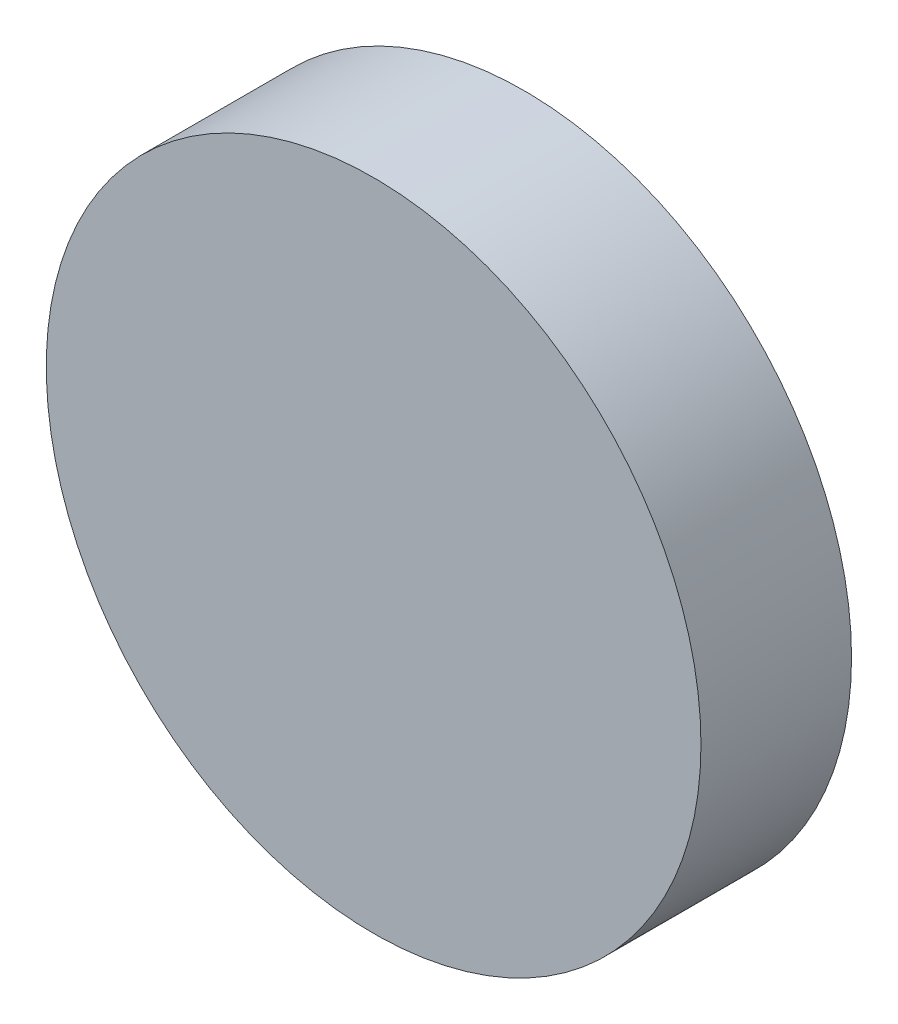
ISO-10303-21;
HEADER;
FILE_DESCRIPTION(('STEP AP214'),'2;1');
FILE_NAME('part.step','',(''),(''),'','','');
FILE_SCHEMA(('AUTOMOTIVE_DESIGN { 1 0 10303 214 1 1 1 1 }'));
ENDSEC;
DATA;
#1=APPLICATION_CONTEXT('core data for automotive mechanical design processes');
#2=APPLICATION_PROTOCOL_DEFINITION('international standard','automotive_design',2000,#1);
#3=PRODUCT_CONTEXT('',#1,'mechanical');
#4=PRODUCT('Part','Part','',(#3));
#5=PRODUCT_RELATED_PRODUCT_CATEGORY('part','',(#4));
#6=PRODUCT_DEFINITION_FORMATION('','',#4);
#7=PRODUCT_DEFINITION_CONTEXT('part definition',#1,'design');
#8=PRODUCT_DEFINITION('design','',#6,#7);
#9=PRODUCT_DEFINITION_SHAPE('','',#8);
#10=(LENGTH_UNIT() NAMED_UNIT(*) SI_UNIT(.MILLI.,.METRE.));
#11=(NAMED_UNIT(*) PLANE_ANGLE_UNIT() SI_UNIT($,.RADIAN.));
#12=(NAMED_UNIT(*) SI_UNIT($,.STERADIAN.) SOLID_ANGLE_UNIT());
#13=UNCERTAINTY_MEASURE_WITH_UNIT(LENGTH_MEASURE(1.E-05),#10,'distance_accuracy_value','');
#14=(GEOMETRIC_REPRESENTATION_CONTEXT(3) GLOBAL_UNCERTAINTY_ASSIGNED_CONTEXT((#13)) GLOBAL_UNIT_ASSIGNED_CONTEXT((#10,
#11,#12)) REPRESENTATION_CONTEXT('',''));
#15=CARTESIAN_POINT('',(0.,0.,0.));
#16=DIRECTION('',(0.,0.,1.));
#17=DIRECTION('',(1.,0.,0.));
#18=AXIS2_PLACEMENT_3D('',#15,#16,#17);
#19=CARTESIAN_POINT('',(40.499174310354,24.6252967338106,2.3));
#20=DIRECTION('',(0.,0.,-1.));
#21=DIRECTION('',(-1.,0.,0.));
#22=AXIS2_PLACEMENT_3D('',#19,#20,#21);
#23=CYLINDRICAL_SURFACE('',#22,5.);
#24=CARTESIAN_POINT('',(40.499174310354,24.6252967338106,2.3));
#25=DIRECTION('',(0.,0.,1.));
#26=DIRECTION('',(1.,0.,0.));
#27=AXIS2_PLACEMENT_3D('',#24,#25,#26);
#28=CIRCLE('',#27,5.);
#29=CARTESIAN_POINT('',(45.499174310354,24.6252967338106,2.3));
#30=VERTEX_POINT('',#29);
#31=EDGE_CURVE('E10',#30,#30,#28,.T.);
#32=ORIENTED_EDGE('',*,*,#31,.F.);
#33=EDGE_LOOP('',(#32));
#34=FACE_BOUND('',#33,.T.);
#35=CARTESIAN_POINT('',(40.499174310354,24.6252967338106,0.));
#36=DIRECTION('',(0.,0.,1.));
#37=DIRECTION('',(1.,0.,0.));
#38=AXIS2_PLACEMENT_3D('',#35,#36,#37);
#39=CIRCLE('',#38,5.);
#40=CARTESIAN_POINT('',(45.499174310354,24.6252967338106,0.));
#41=VERTEX_POINT('',#40);
#42=EDGE_CURVE('E38',#41,#41,#39,.T.);
#43=ORIENTED_EDGE('',*,*,#42,.T.);
#44=EDGE_LOOP('',(#43));
#45=FACE_BOUND('',#44,.T.);
#46=ADVANCED_FACE('F35',(#34,#45),#23,.T.);
#47=CARTESIAN_POINT('',(40.499174310354,24.6252967338106,2.3));
#48=DIRECTION('',(0.,0.,1.));
#49=DIRECTION('',(1.,0.,0.));
#50=AXIS2_PLACEMENT_3D('',#47,#48,#49);
#51=PLANE('',#50);
#52=ORIENTED_EDGE('',*,*,#31,.T.);
#53=EDGE_LOOP('',(#52));
#54=FACE_BOUND('',#53,.T.);
#55=ADVANCED_FACE('F50',(#54),#51,.T.);
#56=CARTESIAN_POINT('',(40.499174310354,24.6252967338106,0.));
#57=DIRECTION('',(0.,0.,1.));
#58=DIRECTION('',(1.,0.,0.));
#59=AXIS2_PLACEMENT_3D('',#56,#57,#58);
#60=PLANE('',#59);
#61=ORIENTED_EDGE('',*,*,#42,.F.);
#62=EDGE_LOOP('',(#61));
#63=FACE_BOUND('',#62,.T.);
#64=ADVANCED_FACE('F48',(#63),#60,.F.);
#65=CLOSED_SHELL('',(#46,#55,#64));
#66=MANIFOLD_SOLID_BREP('B2',#65);
#67=ADVANCED_BREP_SHAPE_REPRESENTATION('',(#18,#66),#14);
#68=SHAPE_DEFINITION_REPRESENTATION(#9,#67);
ENDSEC;
END-ISO-10303-21;
